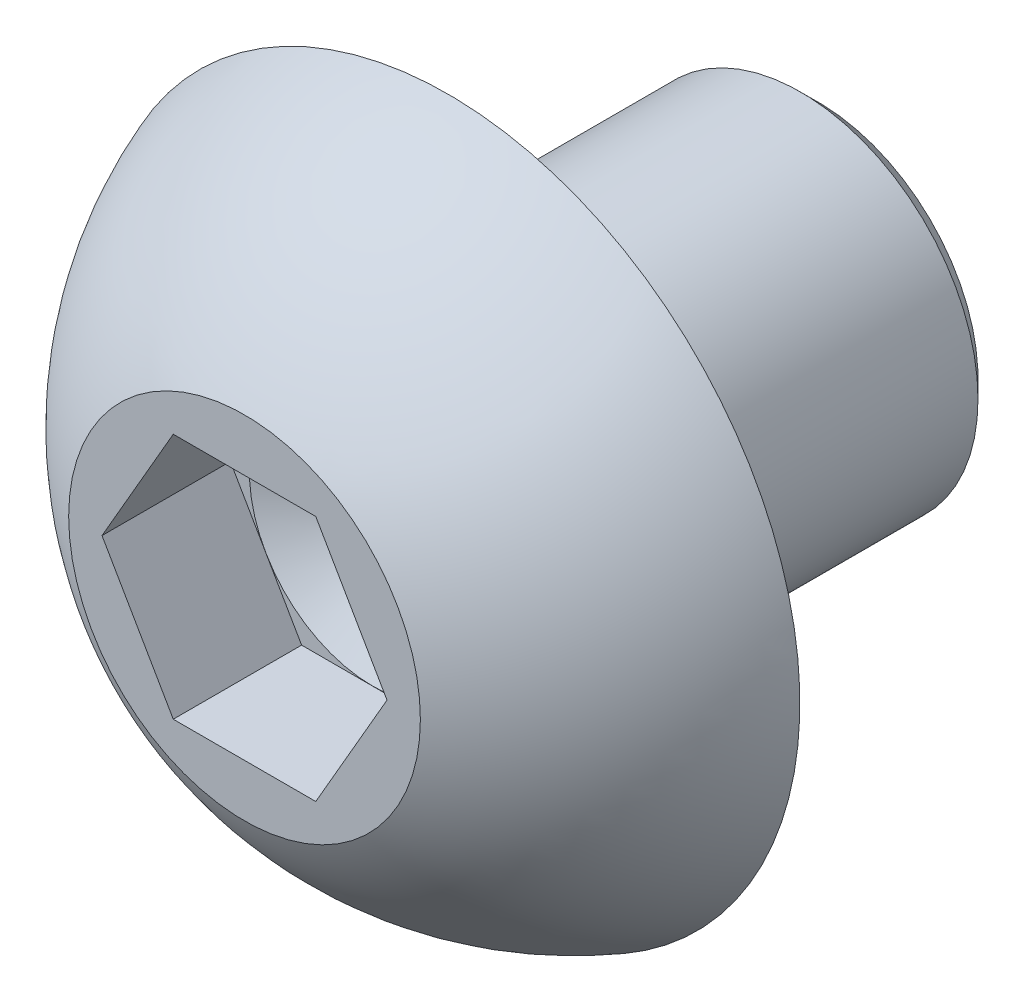
ISO-10303-21;
HEADER;
FILE_DESCRIPTION(('STEP AP214'),'2;1');
FILE_NAME('part.step','',(''),(''),'','','');
FILE_SCHEMA(('AUTOMOTIVE_DESIGN { 1 0 10303 214 1 1 1 1 }'));
ENDSEC;
DATA;
#1=APPLICATION_CONTEXT('core data for automotive mechanical design processes');
#2=APPLICATION_PROTOCOL_DEFINITION('international standard','automotive_design',2000,#1);
#3=PRODUCT_CONTEXT('',#1,'mechanical');
#4=PRODUCT('Part','Part','',(#3));
#5=PRODUCT_RELATED_PRODUCT_CATEGORY('part','',(#4));
#6=PRODUCT_DEFINITION_FORMATION('','',#4);
#7=PRODUCT_DEFINITION_CONTEXT('part definition',#1,'design');
#8=PRODUCT_DEFINITION('design','',#6,#7);
#9=PRODUCT_DEFINITION_SHAPE('','',#8);
#10=(LENGTH_UNIT() NAMED_UNIT(*) SI_UNIT(.MILLI.,.METRE.));
#11=(NAMED_UNIT(*) PLANE_ANGLE_UNIT() SI_UNIT($,.RADIAN.));
#12=(NAMED_UNIT(*) SI_UNIT($,.STERADIAN.) SOLID_ANGLE_UNIT());
#13=UNCERTAINTY_MEASURE_WITH_UNIT(LENGTH_MEASURE(1.E-05),#10,'distance_accuracy_value','');
#14=(GEOMETRIC_REPRESENTATION_CONTEXT(3) GLOBAL_UNCERTAINTY_ASSIGNED_CONTEXT((#13)) GLOBAL_UNIT_ASSIGNED_CONTEXT((#10,
#11,#12)) REPRESENTATION_CONTEXT('',''));
#15=CARTESIAN_POINT('',(0.,0.,0.));
#16=DIRECTION('',(0.,0.,1.));
#17=DIRECTION('',(1.,0.,0.));
#18=AXIS2_PLACEMENT_3D('',#15,#16,#17);
#19=CARTESIAN_POINT('',(0.,1.425,1.65));
#20=DIRECTION('',(0.,0.,1.));
#21=DIRECTION('',(1.,0.,0.));
#22=AXIS2_PLACEMENT_3D('',#19,#20,#21);
#23=PLANE('',#22);
#24=DIRECTION('',(0.5,0.866025403784439,0.));
#25=VECTOR('',#24,1.);
#26=CARTESIAN_POINT('',(0.577350269189626,-1.,1.65));
#27=LINE('',#26,#25);
#28=CARTESIAN_POINT('',(0.577350269189626,-1.,1.65));
#29=VERTEX_POINT('',#28);
#30=CARTESIAN_POINT('',(1.15470053837925,0.,1.65));
#31=VERTEX_POINT('',#30);
#32=EDGE_CURVE('E87',#29,#31,#27,.T.);
#33=ORIENTED_EDGE('',*,*,#32,.F.);
#34=DIRECTION('',(1.,0.,0.));
#35=VECTOR('',#34,1.);
#36=CARTESIAN_POINT('',(-0.577350269189626,-1.,1.65));
#37=LINE('',#36,#35);
#38=CARTESIAN_POINT('',(-0.577350269189626,-1.,1.65));
#39=VERTEX_POINT('',#38);
#40=EDGE_CURVE('E91',#39,#29,#37,.T.);
#41=ORIENTED_EDGE('',*,*,#40,.F.);
#42=DIRECTION('',(0.5,-0.866025403784439,0.));
#43=VECTOR('',#42,1.);
#44=CARTESIAN_POINT('',(-1.15470053837925,0.,1.65));
#45=LINE('',#44,#43);
#46=CARTESIAN_POINT('',(-1.15470053837925,0.,1.65));
#47=VERTEX_POINT('',#46);
#48=EDGE_CURVE('E111',#47,#39,#45,.T.);
#49=ORIENTED_EDGE('',*,*,#48,.F.);
#50=DIRECTION('',(-0.5,-0.866025403784439,0.));
#51=VECTOR('',#50,1.);
#52=CARTESIAN_POINT('',(-0.577350269189626,1.,1.65));
#53=LINE('',#52,#51);
#54=CARTESIAN_POINT('',(-0.577350269189626,1.,1.65));
#55=VERTEX_POINT('',#54);
#56=EDGE_CURVE('E392',#55,#47,#53,.T.);
#57=ORIENTED_EDGE('',*,*,#56,.F.);
#58=DIRECTION('',(-1.,0.,0.));
#59=VECTOR('',#58,1.);
#60=CARTESIAN_POINT('',(0.577350269189626,1.,1.65));
#61=LINE('',#60,#59);
#62=CARTESIAN_POINT('',(0.577350269189626,1.,1.65));
#63=VERTEX_POINT('',#62);
#64=EDGE_CURVE('E394',#63,#55,#61,.T.);
#65=ORIENTED_EDGE('',*,*,#64,.F.);
#66=DIRECTION('',(-0.5,0.866025403784439,0.));
#67=VECTOR('',#66,1.);
#68=CARTESIAN_POINT('',(1.15470053837925,0.,1.65));
#69=LINE('',#68,#67);
#70=EDGE_CURVE('E94',#31,#63,#69,.T.);
#71=ORIENTED_EDGE('',*,*,#70,.F.);
#72=EDGE_LOOP('',(#33,#41,#49,#57,#65,#71));
#73=FACE_BOUND('',#72,.T.);
#74=CARTESIAN_POINT('',(0.,0.,1.65));
#75=DIRECTION('',(0.,0.,-1.));
#76=DIRECTION('',(-1.,0.,0.));
#77=AXIS2_PLACEMENT_3D('',#74,#75,#76);
#78=CIRCLE('',#77,1.425);
#79=CARTESIAN_POINT('',(-1.425,0.,1.65));
#80=VERTEX_POINT('',#79);
#81=EDGE_CURVE('E126',#80,#80,#78,.T.);
#82=ORIENTED_EDGE('',*,*,#81,.F.);
#83=EDGE_LOOP('',(#82));
#84=FACE_BOUND('',#83,.T.);
#85=ADVANCED_FACE('F17',(#73,#84),#23,.T.);
#86=CARTESIAN_POINT('',(0.,0.,-3.));
#87=DIRECTION('',(0.,0.,-1.));
#88=DIRECTION('',(-1.,0.,0.));
#89=AXIS2_PLACEMENT_3D('',#86,#87,#88);
#90=PLANE('',#89);
#91=CARTESIAN_POINT('',(0.,0.,-3.));
#92=DIRECTION('',(0.,0.,-1.));
#93=DIRECTION('',(-1.,0.,0.));
#94=AXIS2_PLACEMENT_3D('',#91,#92,#93);
#95=CIRCLE('',#94,1.2933);
#96=CARTESIAN_POINT('',(-1.2933,0.,-3.));
#97=VERTEX_POINT('',#96);
#98=EDGE_CURVE('E25',#97,#97,#95,.T.);
#99=ORIENTED_EDGE('',*,*,#98,.T.);
#100=EDGE_LOOP('',(#99));
#101=FACE_BOUND('',#100,.T.);
#102=ADVANCED_FACE('F142',(#101),#90,.T.);
#103=CARTESIAN_POINT('',(0.,0.,0.));
#104=DIRECTION('',(0.,0.,-1.));
#105=DIRECTION('',(-1.,0.,0.));
#106=AXIS2_PLACEMENT_3D('',#103,#104,#105);
#107=CYLINDRICAL_SURFACE('',#106,1.437);
#108=CARTESIAN_POINT('',(0.,0.,-2.8563));
#109=DIRECTION('',(0.,0.,1.));
#110=DIRECTION('',(1.,0.,0.));
#111=AXIS2_PLACEMENT_3D('',#108,#109,#110);
#112=CIRCLE('',#111,1.437);
#113=CARTESIAN_POINT('',(1.437,0.,-2.8563));
#114=VERTEX_POINT('',#113);
#115=EDGE_CURVE('E11',#114,#114,#112,.T.);
#116=ORIENTED_EDGE('',*,*,#115,.T.);
#117=EDGE_LOOP('',(#116));
#118=FACE_BOUND('',#117,.T.);
#119=CARTESIAN_POINT('',(0.,0.,-0.1));
#120=DIRECTION('',(0.,0.,-1.));
#121=DIRECTION('',(-1.,0.,0.));
#122=AXIS2_PLACEMENT_3D('',#119,#120,#121);
#123=CIRCLE('',#122,1.437);
#124=CARTESIAN_POINT('',(-1.437,0.,-0.1));
#125=VERTEX_POINT('',#124);
#126=EDGE_CURVE('E134',#125,#125,#123,.T.);
#127=ORIENTED_EDGE('',*,*,#126,.T.);
#128=EDGE_LOOP('',(#127));
#129=FACE_BOUND('',#128,.T.);
#130=ADVANCED_FACE('F160',(#118,#129),#107,.T.);
#131=CARTESIAN_POINT('',(0.,1.437,0.));
#132=DIRECTION('',(0.,0.,-1.));
#133=DIRECTION('',(-1.,0.,0.));
#134=AXIS2_PLACEMENT_3D('',#131,#132,#133);
#135=PLANE('',#134);
#136=CARTESIAN_POINT('',(0.,0.,0.));
#137=DIRECTION('',(0.,0.,-1.));
#138=DIRECTION('',(-1.,0.,0.));
#139=AXIS2_PLACEMENT_3D('',#136,#137,#138);
#140=CIRCLE('',#139,1.537);
#141=CARTESIAN_POINT('',(-1.537,0.,0.));
#142=VERTEX_POINT('',#141);
#143=EDGE_CURVE('E137',#142,#142,#140,.F.);
#144=ORIENTED_EDGE('',*,*,#143,.T.);
#145=EDGE_LOOP('',(#144));
#146=FACE_BOUND('',#145,.T.);
#147=CARTESIAN_POINT('',(0.,0.,0.));
#148=DIRECTION('',(0.,0.,-1.));
#149=DIRECTION('',(-1.,0.,0.));
#150=AXIS2_PLACEMENT_3D('',#147,#148,#149);
#151=CIRCLE('',#150,2.85);
#152=CARTESIAN_POINT('',(-2.85,0.,0.));
#153=VERTEX_POINT('',#152);
#154=EDGE_CURVE('E131',#153,#153,#151,.T.);
#155=ORIENTED_EDGE('',*,*,#154,.T.);
#156=EDGE_LOOP('',(#155));
#157=FACE_BOUND('',#156,.T.);
#158=ADVANCED_FACE('F167',(#146,#157),#135,.T.);
#159=CARTESIAN_POINT('',(0.,0.,-1.02102272727273));
#160=DIRECTION('',(0.,0.,-1.));
#161=DIRECTION('',(0.,1.,0.));
#162=AXIS2_PLACEMENT_3D('',#159,#160,#161);
#163=SPHERICAL_SURFACE('',#162,3.02737302121946);
#164=ORIENTED_EDGE('',*,*,#81,.T.);
#165=EDGE_LOOP('',(#164));
#166=FACE_BOUND('',#165,.T.);
#167=ORIENTED_EDGE('',*,*,#154,.F.);
#168=EDGE_LOOP('',(#167));
#169=FACE_BOUND('',#168,.T.);
#170=ADVANCED_FACE('F164',(#166,#169),#163,.T.);
#171=CARTESIAN_POINT('',(0.577350269189626,-1.,1.65));
#172=DIRECTION('',(-0.866025403784439,0.5,0.));
#173=DIRECTION('',(-0.5,-0.866025403784439,0.));
#174=AXIS2_PLACEMENT_3D('',#171,#172,#173);
#175=PLANE('',#174);
#176=DIRECTION('',(0.5,0.866025403784439,0.));
#177=VECTOR('',#176,1.);
#178=CARTESIAN_POINT('',(0.577350269189626,-1.,0.61));
#179=LINE('',#178,#177);
#180=CARTESIAN_POINT('',(0.86602540378444,-0.5,0.61));
#181=VERTEX_POINT('',#180);
#182=CARTESIAN_POINT('',(1.15470053837925,0.,0.61));
#183=VERTEX_POINT('',#182);
#184=EDGE_CURVE('E388',#181,#183,#179,.T.);
#185=ORIENTED_EDGE('',*,*,#184,.F.);
#186=CARTESIAN_POINT('',(0.577350269189626,-1.,0.61));
#187=VERTEX_POINT('',#186);
#188=EDGE_CURVE('E116',#187,#181,#179,.T.);
#189=ORIENTED_EDGE('',*,*,#188,.F.);
#190=DIRECTION('',(0.,0.,-1.));
#191=VECTOR('',#190,1.);
#192=CARTESIAN_POINT('',(0.577350269189626,-1.,1.65));
#193=LINE('',#192,#191);
#194=EDGE_CURVE('E106',#29,#187,#193,.T.);
#195=ORIENTED_EDGE('',*,*,#194,.F.);
#196=ORIENTED_EDGE('',*,*,#32,.T.);
#197=DIRECTION('',(0.,0.,-1.));
#198=VECTOR('',#197,1.);
#199=CARTESIAN_POINT('',(1.15470053837925,0.,1.65));
#200=LINE('',#199,#198);
#201=EDGE_CURVE('E122',#31,#183,#200,.T.);
#202=ORIENTED_EDGE('',*,*,#201,.T.);
#203=EDGE_LOOP('',(#185,#189,#195,#196,#202));
#204=FACE_BOUND('',#203,.T.);
#205=ADVANCED_FACE('F114',(#204),#175,.T.);
#206=CARTESIAN_POINT('',(1.15470053837925,0.,1.65));
#207=DIRECTION('',(-0.866025403784439,-0.5,0.));
#208=DIRECTION('',(0.5,-0.866025403784439,0.));
#209=AXIS2_PLACEMENT_3D('',#206,#207,#208);
#210=PLANE('',#209);
#211=DIRECTION('',(-0.5,0.866025403784439,0.));
#212=VECTOR('',#211,1.);
#213=CARTESIAN_POINT('',(1.15470053837925,0.,0.61));
#214=LINE('',#213,#212);
#215=CARTESIAN_POINT('',(0.866025403784439,0.5,0.61));
#216=VERTEX_POINT('',#215);
#217=CARTESIAN_POINT('',(0.577350269189626,1.,0.61));
#218=VERTEX_POINT('',#217);
#219=EDGE_CURVE('E366',#216,#218,#214,.T.);
#220=ORIENTED_EDGE('',*,*,#219,.F.);
#221=EDGE_CURVE('E363',#183,#216,#214,.T.);
#222=ORIENTED_EDGE('',*,*,#221,.F.);
#223=ORIENTED_EDGE('',*,*,#201,.F.);
#224=ORIENTED_EDGE('',*,*,#70,.T.);
#225=DIRECTION('',(0.,0.,-1.));
#226=VECTOR('',#225,1.);
#227=CARTESIAN_POINT('',(0.577350269189626,1.,1.65));
#228=LINE('',#227,#226);
#229=EDGE_CURVE('E380',#63,#218,#228,.T.);
#230=ORIENTED_EDGE('',*,*,#229,.T.);
#231=EDGE_LOOP('',(#220,#222,#223,#224,#230));
#232=FACE_BOUND('',#231,.T.);
#233=ADVANCED_FACE('F201',(#232),#210,.T.);
#234=CARTESIAN_POINT('',(0.577350269189626,1.,1.65));
#235=DIRECTION('',(0.,-1.,0.));
#236=DIRECTION('',(1.,0.,0.));
#237=AXIS2_PLACEMENT_3D('',#234,#235,#236);
#238=PLANE('',#237);
#239=DIRECTION('',(-1.,0.,0.));
#240=VECTOR('',#239,1.);
#241=CARTESIAN_POINT('',(0.577350269189626,1.,0.61));
#242=LINE('',#241,#240);
#243=CARTESIAN_POINT('',(0.,1.,0.61));
#244=VERTEX_POINT('',#243);
#245=CARTESIAN_POINT('',(-0.577350269189626,1.,0.61));
#246=VERTEX_POINT('',#245);
#247=EDGE_CURVE('E353',#244,#246,#242,.T.);
#248=ORIENTED_EDGE('',*,*,#247,.F.);
#249=EDGE_CURVE('E360',#218,#244,#242,.T.);
#250=ORIENTED_EDGE('',*,*,#249,.F.);
#251=ORIENTED_EDGE('',*,*,#229,.F.);
#252=ORIENTED_EDGE('',*,*,#64,.T.);
#253=DIRECTION('',(0.,0.,-1.));
#254=VECTOR('',#253,1.);
#255=CARTESIAN_POINT('',(-0.577350269189626,1.,1.65));
#256=LINE('',#255,#254);
#257=EDGE_CURVE('E362',#55,#246,#256,.T.);
#258=ORIENTED_EDGE('',*,*,#257,.T.);
#259=EDGE_LOOP('',(#248,#250,#251,#252,#258));
#260=FACE_BOUND('',#259,.T.);
#261=ADVANCED_FACE('F208',(#260),#238,.T.);
#262=CARTESIAN_POINT('',(-0.577350269189626,1.,1.65));
#263=DIRECTION('',(0.866025403784439,-0.5,0.));
#264=DIRECTION('',(0.5,0.866025403784439,0.));
#265=AXIS2_PLACEMENT_3D('',#262,#263,#264);
#266=PLANE('',#265);
#267=DIRECTION('',(-0.5,-0.866025403784439,0.));
#268=VECTOR('',#267,1.);
#269=CARTESIAN_POINT('',(-0.577350269189626,1.,0.61));
#270=LINE('',#269,#268);
#271=CARTESIAN_POINT('',(-0.866025403784439,0.5,0.61));
#272=VERTEX_POINT('',#271);
#273=CARTESIAN_POINT('',(-1.15470053837925,0.,0.61));
#274=VERTEX_POINT('',#273);
#275=EDGE_CURVE('E368',#272,#274,#270,.T.);
#276=ORIENTED_EDGE('',*,*,#275,.F.);
#277=EDGE_CURVE('E356',#246,#272,#270,.T.);
#278=ORIENTED_EDGE('',*,*,#277,.F.);
#279=ORIENTED_EDGE('',*,*,#257,.F.);
#280=ORIENTED_EDGE('',*,*,#56,.T.);
#281=DIRECTION('',(0.,0.,-1.));
#282=VECTOR('',#281,1.);
#283=CARTESIAN_POINT('',(-1.15470053837925,0.,1.65));
#284=LINE('',#283,#282);
#285=EDGE_CURVE('E118',#47,#274,#284,.T.);
#286=ORIENTED_EDGE('',*,*,#285,.T.);
#287=EDGE_LOOP('',(#276,#278,#279,#280,#286));
#288=FACE_BOUND('',#287,.T.);
#289=ADVANCED_FACE('F217',(#288),#266,.T.);
#290=CARTESIAN_POINT('',(-1.15470053837925,0.,1.65));
#291=DIRECTION('',(0.866025403784439,0.5,0.));
#292=DIRECTION('',(-0.5,0.866025403784439,0.));
#293=AXIS2_PLACEMENT_3D('',#290,#291,#292);
#294=PLANE('',#293);
#295=DIRECTION('',(0.5,-0.866025403784439,0.));
#296=VECTOR('',#295,1.);
#297=CARTESIAN_POINT('',(-1.15470053837925,0.,0.61));
#298=LINE('',#297,#296);
#299=CARTESIAN_POINT('',(-0.866025403784439,-0.5,0.61));
#300=VERTEX_POINT('',#299);
#301=CARTESIAN_POINT('',(-0.577350269189626,-1.,0.61));
#302=VERTEX_POINT('',#301);
#303=EDGE_CURVE('E373',#300,#302,#298,.T.);
#304=ORIENTED_EDGE('',*,*,#303,.F.);
#305=EDGE_CURVE('E32',#274,#300,#298,.T.);
#306=ORIENTED_EDGE('',*,*,#305,.F.);
#307=ORIENTED_EDGE('',*,*,#285,.F.);
#308=ORIENTED_EDGE('',*,*,#48,.T.);
#309=DIRECTION('',(0.,0.,-1.));
#310=VECTOR('',#309,1.);
#311=CARTESIAN_POINT('',(-0.577350269189626,-1.,1.65));
#312=LINE('',#311,#310);
#313=EDGE_CURVE('E110',#39,#302,#312,.T.);
#314=ORIENTED_EDGE('',*,*,#313,.T.);
#315=EDGE_LOOP('',(#304,#306,#307,#308,#314));
#316=FACE_BOUND('',#315,.T.);
#317=ADVANCED_FACE('F226',(#316),#294,.T.);
#318=CARTESIAN_POINT('',(-0.577350269189626,-1.,1.65));
#319=DIRECTION('',(0.,1.,0.));
#320=DIRECTION('',(-1.,0.,0.));
#321=AXIS2_PLACEMENT_3D('',#318,#319,#320);
#322=PLANE('',#321);
#323=DIRECTION('',(1.,0.,0.));
#324=VECTOR('',#323,1.);
#325=CARTESIAN_POINT('',(-0.577350269189626,-1.,0.61));
#326=LINE('',#325,#324);
#327=CARTESIAN_POINT('',(0.,-1.,0.61));
#328=VERTEX_POINT('',#327);
#329=EDGE_CURVE('E375',#328,#187,#326,.T.);
#330=ORIENTED_EDGE('',*,*,#329,.F.);
#331=EDGE_CURVE('E99',#302,#328,#326,.T.);
#332=ORIENTED_EDGE('',*,*,#331,.F.);
#333=ORIENTED_EDGE('',*,*,#313,.F.);
#334=ORIENTED_EDGE('',*,*,#40,.T.);
#335=ORIENTED_EDGE('',*,*,#194,.T.);
#336=EDGE_LOOP('',(#330,#332,#333,#334,#335));
#337=FACE_BOUND('',#336,.T.);
#338=ADVANCED_FACE('F105',(#337),#322,.T.);
#339=CARTESIAN_POINT('',(0.577350269189626,-1.,0.61));
#340=DIRECTION('',(0.,0.,-1.));
#341=DIRECTION('',(-1.,0.,0.));
#342=AXIS2_PLACEMENT_3D('',#339,#340,#341);
#343=PLANE('',#342);
#344=ORIENTED_EDGE('',*,*,#303,.T.);
#345=ORIENTED_EDGE('',*,*,#331,.T.);
#346=CARTESIAN_POINT('',(0.,0.,0.61));
#347=DIRECTION('',(0.,0.,-1.));
#348=DIRECTION('',(-1.,0.,0.));
#349=AXIS2_PLACEMENT_3D('',#346,#347,#348);
#350=CIRCLE('',#349,1.);
#351=EDGE_CURVE('E381',#328,#300,#350,.T.);
#352=ORIENTED_EDGE('',*,*,#351,.T.);
#353=EDGE_LOOP('',(#344,#345,#352));
#354=FACE_BOUND('',#353,.T.);
#355=ADVANCED_FACE('F243',(#354),#343,.F.);
#356=ORIENTED_EDGE('',*,*,#329,.T.);
#357=ORIENTED_EDGE('',*,*,#188,.T.);
#358=EDGE_CURVE('E384',#181,#328,#350,.T.);
#359=ORIENTED_EDGE('',*,*,#358,.T.);
#360=EDGE_LOOP('',(#356,#357,#359));
#361=FACE_BOUND('',#360,.T.);
#362=ADVANCED_FACE('F251',(#361),#343,.F.);
#363=ORIENTED_EDGE('',*,*,#184,.T.);
#364=ORIENTED_EDGE('',*,*,#221,.T.);
#365=EDGE_CURVE('E385',#216,#181,#350,.T.);
#366=ORIENTED_EDGE('',*,*,#365,.T.);
#367=EDGE_LOOP('',(#363,#364,#366));
#368=FACE_BOUND('',#367,.T.);
#369=ADVANCED_FACE('F261',(#368),#343,.F.);
#370=ORIENTED_EDGE('',*,*,#219,.T.);
#371=ORIENTED_EDGE('',*,*,#249,.T.);
#372=EDGE_CURVE('E127',#244,#216,#350,.T.);
#373=ORIENTED_EDGE('',*,*,#372,.T.);
#374=EDGE_LOOP('',(#370,#371,#373));
#375=FACE_BOUND('',#374,.T.);
#376=ADVANCED_FACE('F269',(#375),#343,.F.);
#377=ORIENTED_EDGE('',*,*,#247,.T.);
#378=ORIENTED_EDGE('',*,*,#277,.T.);
#379=EDGE_CURVE('E124',#272,#244,#350,.T.);
#380=ORIENTED_EDGE('',*,*,#379,.T.);
#381=EDGE_LOOP('',(#377,#378,#380));
#382=FACE_BOUND('',#381,.T.);
#383=ADVANCED_FACE('F277',(#382),#343,.F.);
#384=ORIENTED_EDGE('',*,*,#275,.T.);
#385=ORIENTED_EDGE('',*,*,#305,.T.);
#386=EDGE_CURVE('E128',#300,#272,#350,.T.);
#387=ORIENTED_EDGE('',*,*,#386,.T.);
#388=EDGE_LOOP('',(#384,#385,#387));
#389=FACE_BOUND('',#388,.T.);
#390=ADVANCED_FACE('F254',(#389),#343,.F.);
#391=CARTESIAN_POINT('',(0.,0.,0.0326497308103697));
#392=DIRECTION('',(0.,0.,1.));
#393=DIRECTION('',(1.,0.,0.));
#394=AXIS2_PLACEMENT_3D('',#391,#392,#393);
#395=CONICAL_SURFACE('',#394,0.,1.0471975511966);
#396=ORIENTED_EDGE('',*,*,#379,.F.);
#397=ORIENTED_EDGE('',*,*,#386,.F.);
#398=ORIENTED_EDGE('',*,*,#351,.F.);
#399=ORIENTED_EDGE('',*,*,#358,.F.);
#400=ORIENTED_EDGE('',*,*,#365,.F.);
#401=ORIENTED_EDGE('',*,*,#372,.F.);
#402=EDGE_LOOP('',(#396,#397,#398,#399,#400,#401));
#403=FACE_BOUND('',#402,.T.);
#404=CARTESIAN_POINT('',(0.,0.,0.0326497308103697));
#405=VERTEX_POINT('',#404);
#406=VERTEX_LOOP('',#405);
#407=FACE_BOUND('',#406,.T.);
#408=ADVANCED_FACE('F151',(#403,#407),#395,.F.);
#409=CARTESIAN_POINT('',(0.,0.,-0.1));
#410=DIRECTION('',(0.,0.,-1.));
#411=DIRECTION('',(-1.,0.,0.));
#412=AXIS2_PLACEMENT_3D('',#409,#410,#411);
#413=TOROIDAL_SURFACE('',#412,1.537,0.1);
#414=ORIENTED_EDGE('',*,*,#143,.F.);
#415=EDGE_LOOP('',(#414));
#416=FACE_BOUND('',#415,.T.);
#417=ORIENTED_EDGE('',*,*,#126,.F.);
#418=EDGE_LOOP('',(#417));
#419=FACE_BOUND('',#418,.T.);
#420=ADVANCED_FACE('F145',(#416,#419),#413,.F.);
#421=CARTESIAN_POINT('',(0.,0.,-3.));
#422=DIRECTION('',(0.,0.,1.));
#423=DIRECTION('',(1.,0.,0.));
#424=AXIS2_PLACEMENT_3D('',#421,#422,#423);
#425=CONICAL_SURFACE('',#424,1.2933,0.785398163397448);
#426=ORIENTED_EDGE('',*,*,#115,.F.);
#427=EDGE_LOOP('',(#426));
#428=FACE_BOUND('',#427,.T.);
#429=ORIENTED_EDGE('',*,*,#98,.F.);
#430=EDGE_LOOP('',(#429));
#431=FACE_BOUND('',#430,.T.);
#432=ADVANCED_FACE('F19',(#428,#431),#425,.T.);
#433=CLOSED_SHELL('',(#85,#102,#130,#158,#170,#205,#233,#261,#289,#317,#338,#355,#362,#369,#376,
#383,#390,#408,#420,#432));
#434=MANIFOLD_SOLID_BREP('B1',#433);
#435=ADVANCED_BREP_SHAPE_REPRESENTATION('',(#18,#434),#14);
#436=SHAPE_DEFINITION_REPRESENTATION(#9,#435);
ENDSEC;
END-ISO-10303-21;
